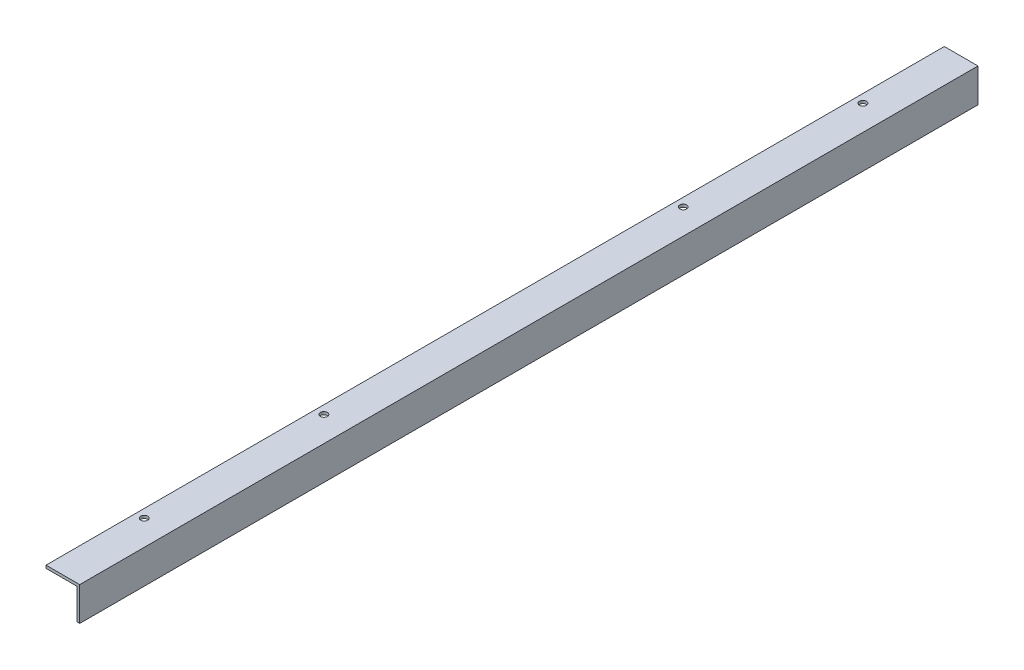
ISO-10303-21;
HEADER;
FILE_DESCRIPTION(('STEP AP214'),'2;1');
FILE_NAME('part.step','',(''),(''),'','','');
FILE_SCHEMA(('AUTOMOTIVE_DESIGN { 1 0 10303 214 1 1 1 1 }'));
ENDSEC;
DATA;
#1=APPLICATION_CONTEXT('core data for automotive mechanical design processes');
#2=APPLICATION_PROTOCOL_DEFINITION('international standard','automotive_design',2000,#1);
#3=PRODUCT_CONTEXT('',#1,'mechanical');
#4=PRODUCT('Part','Part','',(#3));
#5=PRODUCT_RELATED_PRODUCT_CATEGORY('part','',(#4));
#6=PRODUCT_DEFINITION_FORMATION('','',#4);
#7=PRODUCT_DEFINITION_CONTEXT('part definition',#1,'design');
#8=PRODUCT_DEFINITION('design','',#6,#7);
#9=PRODUCT_DEFINITION_SHAPE('','',#8);
#10=(LENGTH_UNIT() NAMED_UNIT(*) SI_UNIT(.MILLI.,.METRE.));
#11=(NAMED_UNIT(*) PLANE_ANGLE_UNIT() SI_UNIT($,.RADIAN.));
#12=(NAMED_UNIT(*) SI_UNIT($,.STERADIAN.) SOLID_ANGLE_UNIT());
#13=UNCERTAINTY_MEASURE_WITH_UNIT(LENGTH_MEASURE(1.E-05),#10,'distance_accuracy_value','');
#14=(GEOMETRIC_REPRESENTATION_CONTEXT(3) GLOBAL_UNCERTAINTY_ASSIGNED_CONTEXT((#13)) GLOBAL_UNIT_ASSIGNED_CONTEXT((#10,
#11,#12)) REPRESENTATION_CONTEXT('',''));
#15=CARTESIAN_POINT('',(0.,0.,0.));
#16=DIRECTION('',(0.,0.,1.));
#17=DIRECTION('',(1.,0.,0.));
#18=AXIS2_PLACEMENT_3D('',#15,#16,#17);
#19=CARTESIAN_POINT('',(-28.575,-41.275,914.4));
#20=DIRECTION('',(0.,1.,0.));
#21=DIRECTION('',(0.,0.,1.));
#22=AXIS2_PLACEMENT_3D('',#19,#20,#21);
#23=CYLINDRICAL_SURFACE('',#22,3.96874999999997);
#24=CARTESIAN_POINT('',(-28.575,-3.175,914.4));
#25=DIRECTION('',(0.,1.,0.));
#26=DIRECTION('',(0.,0.,1.));
#27=AXIS2_PLACEMENT_3D('',#24,#25,#26);
#28=CIRCLE('',#27,3.96874999999997);
#29=CARTESIAN_POINT('',(-28.575,-3.175,918.36875));
#30=VERTEX_POINT('',#29);
#31=EDGE_CURVE('E40',#30,#30,#28,.T.);
#32=ORIENTED_EDGE('',*,*,#31,.F.);
#33=EDGE_LOOP('',(#32));
#34=FACE_BOUND('',#33,.T.);
#35=CARTESIAN_POINT('',(-28.575,0.,914.4));
#36=DIRECTION('',(0.,-1.,0.));
#37=DIRECTION('',(1.,0.,0.));
#38=AXIS2_PLACEMENT_3D('',#35,#36,#37);
#39=CIRCLE('',#38,3.96874999999997);
#40=CARTESIAN_POINT('',(-24.60625,0.,914.4));
#41=VERTEX_POINT('',#40);
#42=EDGE_CURVE('E11',#41,#41,#39,.T.);
#43=ORIENTED_EDGE('',*,*,#42,.F.);
#44=EDGE_LOOP('',(#43));
#45=FACE_BOUND('',#44,.T.);
#46=ADVANCED_FACE('F32',(#34,#45),#23,.F.);
#47=CARTESIAN_POINT('',(-28.575,-41.275,711.2));
#48=DIRECTION('',(0.,1.,0.));
#49=DIRECTION('',(0.,0.,1.));
#50=AXIS2_PLACEMENT_3D('',#47,#48,#49);
#51=CYLINDRICAL_SURFACE('',#50,3.96874999999997);
#52=CARTESIAN_POINT('',(-28.575,-3.175,711.2));
#53=DIRECTION('',(0.,1.,0.));
#54=DIRECTION('',(0.,0.,1.));
#55=AXIS2_PLACEMENT_3D('',#52,#53,#54);
#56=CIRCLE('',#55,3.96874999999997);
#57=CARTESIAN_POINT('',(-28.575,-3.175,715.16875));
#58=VERTEX_POINT('',#57);
#59=EDGE_CURVE('E138',#58,#58,#56,.T.);
#60=ORIENTED_EDGE('',*,*,#59,.F.);
#61=EDGE_LOOP('',(#60));
#62=FACE_BOUND('',#61,.T.);
#63=CARTESIAN_POINT('',(-28.575,0.,711.2));
#64=DIRECTION('',(0.,-1.,0.));
#65=DIRECTION('',(1.,0.,0.));
#66=AXIS2_PLACEMENT_3D('',#63,#64,#65);
#67=CIRCLE('',#66,3.96874999999997);
#68=CARTESIAN_POINT('',(-24.60625,0.,711.2));
#69=VERTEX_POINT('',#68);
#70=EDGE_CURVE('E145',#69,#69,#67,.T.);
#71=ORIENTED_EDGE('',*,*,#70,.F.);
#72=EDGE_LOOP('',(#71));
#73=FACE_BOUND('',#72,.T.);
#74=ADVANCED_FACE('F153',(#62,#73),#51,.F.);
#75=CARTESIAN_POINT('',(0.,-38.1,1016.));
#76=DIRECTION('',(-1.,0.,0.));
#77=DIRECTION('',(0.,0.,1.));
#78=AXIS2_PLACEMENT_3D('',#75,#76,#77);
#79=PLANE('',#78);
#80=DIRECTION('',(0.,1.,0.));
#81=VECTOR('',#80,1.);
#82=CARTESIAN_POINT('',(0.,-38.1,0.));
#83=LINE('',#82,#81);
#84=CARTESIAN_POINT('',(0.,-38.1,0.));
#85=VERTEX_POINT('',#84);
#86=CARTESIAN_POINT('',(0.,0.,0.));
#87=VERTEX_POINT('',#86);
#88=EDGE_CURVE('E118',#85,#87,#83,.T.);
#89=ORIENTED_EDGE('',*,*,#88,.T.);
#90=DIRECTION('',(0.,0.,-1.));
#91=VECTOR('',#90,1.);
#92=CARTESIAN_POINT('',(0.,0.,1016.));
#93=LINE('',#92,#91);
#94=CARTESIAN_POINT('',(0.,0.,1016.));
#95=VERTEX_POINT('',#94);
#96=EDGE_CURVE('E136',#95,#87,#93,.T.);
#97=ORIENTED_EDGE('',*,*,#96,.F.);
#98=DIRECTION('',(0.,1.,0.));
#99=VECTOR('',#98,1.);
#100=CARTESIAN_POINT('',(0.,-38.1,1016.));
#101=LINE('',#100,#99);
#102=CARTESIAN_POINT('',(0.,-38.1,1016.));
#103=VERTEX_POINT('',#102);
#104=EDGE_CURVE('E129',#103,#95,#101,.T.);
#105=ORIENTED_EDGE('',*,*,#104,.F.);
#106=DIRECTION('',(0.,0.,-1.));
#107=VECTOR('',#106,1.);
#108=CARTESIAN_POINT('',(0.,-38.1,1016.));
#109=LINE('',#108,#107);
#110=EDGE_CURVE('E114',#103,#85,#109,.T.);
#111=ORIENTED_EDGE('',*,*,#110,.T.);
#112=EDGE_LOOP('',(#89,#97,#105,#111));
#113=FACE_BOUND('',#112,.T.);
#114=ADVANCED_FACE('F159',(#113),#79,.F.);
#115=CARTESIAN_POINT('',(0.,0.,1016.));
#116=DIRECTION('',(0.,-1.,0.));
#117=DIRECTION('',(1.,0.,0.));
#118=AXIS2_PLACEMENT_3D('',#115,#116,#117);
#119=PLANE('',#118);
#120=CARTESIAN_POINT('',(-28.575,0.,304.8));
#121=DIRECTION('',(0.,-1.,0.));
#122=DIRECTION('',(1.,0.,0.));
#123=AXIS2_PLACEMENT_3D('',#120,#121,#122);
#124=CIRCLE('',#123,3.96874999999997);
#125=CARTESIAN_POINT('',(-24.60625,0.,304.8));
#126=VERTEX_POINT('',#125);
#127=EDGE_CURVE('E142',#126,#126,#124,.T.);
#128=ORIENTED_EDGE('',*,*,#127,.T.);
#129=EDGE_LOOP('',(#128));
#130=FACE_BOUND('',#129,.T.);
#131=CARTESIAN_POINT('',(-28.575,0.,101.6));
#132=DIRECTION('',(0.,-1.,0.));
#133=DIRECTION('',(1.,0.,0.));
#134=AXIS2_PLACEMENT_3D('',#131,#132,#133);
#135=CIRCLE('',#134,3.96874999999997);
#136=CARTESIAN_POINT('',(-24.60625,0.,101.6));
#137=VERTEX_POINT('',#136);
#138=EDGE_CURVE('E122',#137,#137,#135,.T.);
#139=ORIENTED_EDGE('',*,*,#138,.T.);
#140=EDGE_LOOP('',(#139));
#141=FACE_BOUND('',#140,.T.);
#142=DIRECTION('',(-1.,0.,0.));
#143=VECTOR('',#142,1.);
#144=CARTESIAN_POINT('',(0.,0.,0.));
#145=LINE('',#144,#143);
#146=CARTESIAN_POINT('',(-38.1,0.,0.));
#147=VERTEX_POINT('',#146);
#148=EDGE_CURVE('E121',#87,#147,#145,.T.);
#149=ORIENTED_EDGE('',*,*,#148,.T.);
#150=DIRECTION('',(0.,0.,-1.));
#151=VECTOR('',#150,1.);
#152=CARTESIAN_POINT('',(-38.1,0.,1016.));
#153=LINE('',#152,#151);
#154=CARTESIAN_POINT('',(-38.1,0.,1016.));
#155=VERTEX_POINT('',#154);
#156=EDGE_CURVE('E133',#155,#147,#153,.T.);
#157=ORIENTED_EDGE('',*,*,#156,.F.);
#158=DIRECTION('',(-1.,0.,0.));
#159=VECTOR('',#158,1.);
#160=CARTESIAN_POINT('',(0.,0.,1016.));
#161=LINE('',#160,#159);
#162=EDGE_CURVE('E86',#95,#155,#161,.T.);
#163=ORIENTED_EDGE('',*,*,#162,.F.);
#164=ORIENTED_EDGE('',*,*,#96,.T.);
#165=EDGE_LOOP('',(#149,#157,#163,#164));
#166=FACE_BOUND('',#165,.T.);
#167=ORIENTED_EDGE('',*,*,#70,.T.);
#168=EDGE_LOOP('',(#167));
#169=FACE_BOUND('',#168,.T.);
#170=ORIENTED_EDGE('',*,*,#42,.T.);
#171=EDGE_LOOP('',(#170));
#172=FACE_BOUND('',#171,.T.);
#173=ADVANCED_FACE('F156',(#130,#141,#166,#169,#172),#119,.F.);
#174=CARTESIAN_POINT('',(-38.1,0.,1016.));
#175=DIRECTION('',(1.,0.,0.));
#176=DIRECTION('',(0.,0.,-1.));
#177=AXIS2_PLACEMENT_3D('',#174,#175,#176);
#178=PLANE('',#177);
#179=DIRECTION('',(0.,-1.,0.));
#180=VECTOR('',#179,1.);
#181=CARTESIAN_POINT('',(-38.1,0.,0.));
#182=LINE('',#181,#180);
#183=CARTESIAN_POINT('',(-38.1,-3.17500000000001,0.));
#184=VERTEX_POINT('',#183);
#185=EDGE_CURVE('E124',#147,#184,#182,.T.);
#186=ORIENTED_EDGE('',*,*,#185,.T.);
#187=DIRECTION('',(0.,0.,-1.));
#188=VECTOR('',#187,1.);
#189=CARTESIAN_POINT('',(-38.1,-3.17500000000001,1016.));
#190=LINE('',#189,#188);
#191=CARTESIAN_POINT('',(-38.1,-3.17500000000001,1016.));
#192=VERTEX_POINT('',#191);
#193=EDGE_CURVE('E109',#192,#184,#190,.T.);
#194=ORIENTED_EDGE('',*,*,#193,.F.);
#195=DIRECTION('',(0.,-1.,0.));
#196=VECTOR('',#195,1.);
#197=CARTESIAN_POINT('',(-38.1,0.,1016.));
#198=LINE('',#197,#196);
#199=EDGE_CURVE('E99',#155,#192,#198,.T.);
#200=ORIENTED_EDGE('',*,*,#199,.F.);
#201=ORIENTED_EDGE('',*,*,#156,.T.);
#202=EDGE_LOOP('',(#186,#194,#200,#201));
#203=FACE_BOUND('',#202,.T.);
#204=ADVANCED_FACE('F158',(#203),#178,.F.);
#205=CARTESIAN_POINT('',(-38.1,-3.17500000000001,1016.));
#206=DIRECTION('',(0.,1.,0.));
#207=DIRECTION('',(0.,0.,1.));
#208=AXIS2_PLACEMENT_3D('',#205,#206,#207);
#209=PLANE('',#208);
#210=CARTESIAN_POINT('',(-28.575,-3.175,304.8));
#211=DIRECTION('',(0.,1.,0.));
#212=DIRECTION('',(0.,0.,1.));
#213=AXIS2_PLACEMENT_3D('',#210,#211,#212);
#214=CIRCLE('',#213,3.96874999999997);
#215=CARTESIAN_POINT('',(-28.575,-3.175,308.76875));
#216=VERTEX_POINT('',#215);
#217=EDGE_CURVE('E210',#216,#216,#214,.T.);
#218=ORIENTED_EDGE('',*,*,#217,.T.);
#219=EDGE_LOOP('',(#218));
#220=FACE_BOUND('',#219,.T.);
#221=CARTESIAN_POINT('',(-28.575,-3.175,101.6));
#222=DIRECTION('',(0.,1.,0.));
#223=DIRECTION('',(0.,0.,1.));
#224=AXIS2_PLACEMENT_3D('',#221,#222,#223);
#225=CIRCLE('',#224,3.96874999999997);
#226=CARTESIAN_POINT('',(-28.575,-3.175,105.56875));
#227=VERTEX_POINT('',#226);
#228=EDGE_CURVE('E139',#227,#227,#225,.T.);
#229=ORIENTED_EDGE('',*,*,#228,.T.);
#230=EDGE_LOOP('',(#229));
#231=FACE_BOUND('',#230,.T.);
#232=DIRECTION('',(1.,0.,0.));
#233=VECTOR('',#232,1.);
#234=CARTESIAN_POINT('',(-38.1,-3.17500000000001,0.));
#235=LINE('',#234,#233);
#236=CARTESIAN_POINT('',(-3.17500000000001,-3.17500000000001,0.));
#237=VERTEX_POINT('',#236);
#238=EDGE_CURVE('E108',#184,#237,#235,.T.);
#239=ORIENTED_EDGE('',*,*,#238,.T.);
#240=DIRECTION('',(0.,0.,-1.));
#241=VECTOR('',#240,1.);
#242=CARTESIAN_POINT('',(-3.17500000000001,-3.17500000000001,1016.));
#243=LINE('',#242,#241);
#244=CARTESIAN_POINT('',(-3.17500000000001,-3.17500000000001,1016.));
#245=VERTEX_POINT('',#244);
#246=EDGE_CURVE('E104',#245,#237,#243,.T.);
#247=ORIENTED_EDGE('',*,*,#246,.F.);
#248=DIRECTION('',(1.,0.,0.));
#249=VECTOR('',#248,1.);
#250=CARTESIAN_POINT('',(-38.1,-3.17500000000001,1016.));
#251=LINE('',#250,#249);
#252=EDGE_CURVE('E93',#192,#245,#251,.T.);
#253=ORIENTED_EDGE('',*,*,#252,.F.);
#254=ORIENTED_EDGE('',*,*,#193,.T.);
#255=EDGE_LOOP('',(#239,#247,#253,#254));
#256=FACE_BOUND('',#255,.T.);
#257=ORIENTED_EDGE('',*,*,#59,.T.);
#258=EDGE_LOOP('',(#257));
#259=FACE_BOUND('',#258,.T.);
#260=ORIENTED_EDGE('',*,*,#31,.T.);
#261=EDGE_LOOP('',(#260));
#262=FACE_BOUND('',#261,.T.);
#263=ADVANCED_FACE('F105',(#220,#231,#256,#259,#262),#209,.F.);
#264=CARTESIAN_POINT('',(-3.17500000000001,-3.17500000000001,1016.));
#265=DIRECTION('',(1.,0.,0.));
#266=DIRECTION('',(0.,1.,0.));
#267=AXIS2_PLACEMENT_3D('',#264,#265,#266);
#268=PLANE('',#267);
#269=DIRECTION('',(0.,-1.,0.));
#270=VECTOR('',#269,1.);
#271=CARTESIAN_POINT('',(-3.17500000000001,-3.17500000000001,0.));
#272=LINE('',#271,#270);
#273=CARTESIAN_POINT('',(-3.175,-38.1,0.));
#274=VERTEX_POINT('',#273);
#275=EDGE_CURVE('E71',#237,#274,#272,.T.);
#276=ORIENTED_EDGE('',*,*,#275,.T.);
#277=DIRECTION('',(0.,0.,-1.));
#278=VECTOR('',#277,1.);
#279=CARTESIAN_POINT('',(-3.175,-38.1,1016.));
#280=LINE('',#279,#278);
#281=CARTESIAN_POINT('',(-3.175,-38.1,1016.));
#282=VERTEX_POINT('',#281);
#283=EDGE_CURVE('E110',#282,#274,#280,.T.);
#284=ORIENTED_EDGE('',*,*,#283,.F.);
#285=DIRECTION('',(0.,-1.,0.));
#286=VECTOR('',#285,1.);
#287=CARTESIAN_POINT('',(-3.17500000000001,-3.17500000000001,1016.));
#288=LINE('',#287,#286);
#289=EDGE_CURVE('E97',#245,#282,#288,.T.);
#290=ORIENTED_EDGE('',*,*,#289,.F.);
#291=ORIENTED_EDGE('',*,*,#246,.T.);
#292=EDGE_LOOP('',(#276,#284,#290,#291));
#293=FACE_BOUND('',#292,.T.);
#294=ADVANCED_FACE('F112',(#293),#268,.F.);
#295=CARTESIAN_POINT('',(-3.175,-38.1,1016.));
#296=DIRECTION('',(0.,1.,0.));
#297=DIRECTION('',(0.,0.,1.));
#298=AXIS2_PLACEMENT_3D('',#295,#296,#297);
#299=PLANE('',#298);
#300=DIRECTION('',(1.,0.,0.));
#301=VECTOR('',#300,1.);
#302=CARTESIAN_POINT('',(-3.175,-38.1,0.));
#303=LINE('',#302,#301);
#304=EDGE_CURVE('E77',#274,#85,#303,.T.);
#305=ORIENTED_EDGE('',*,*,#304,.T.);
#306=ORIENTED_EDGE('',*,*,#110,.F.);
#307=DIRECTION('',(1.,0.,0.));
#308=VECTOR('',#307,1.);
#309=CARTESIAN_POINT('',(-3.175,-38.1,1016.));
#310=LINE('',#309,#308);
#311=EDGE_CURVE('E48',#282,#103,#310,.T.);
#312=ORIENTED_EDGE('',*,*,#311,.F.);
#313=ORIENTED_EDGE('',*,*,#283,.T.);
#314=EDGE_LOOP('',(#305,#306,#312,#313));
#315=FACE_BOUND('',#314,.T.);
#316=ADVANCED_FACE('F186',(#315),#299,.F.);
#317=CARTESIAN_POINT('',(0.,0.,1016.));
#318=DIRECTION('',(0.,0.,1.));
#319=DIRECTION('',(1.,0.,0.));
#320=AXIS2_PLACEMENT_3D('',#317,#318,#319);
#321=PLANE('',#320);
#322=ORIENTED_EDGE('',*,*,#104,.T.);
#323=ORIENTED_EDGE('',*,*,#162,.T.);
#324=ORIENTED_EDGE('',*,*,#199,.T.);
#325=ORIENTED_EDGE('',*,*,#252,.T.);
#326=ORIENTED_EDGE('',*,*,#289,.T.);
#327=ORIENTED_EDGE('',*,*,#311,.T.);
#328=EDGE_LOOP('',(#322,#323,#324,#325,#326,#327));
#329=FACE_BOUND('',#328,.T.);
#330=ADVANCED_FACE('F95',(#329),#321,.T.);
#331=CARTESIAN_POINT('',(0.,0.,0.));
#332=DIRECTION('',(0.,0.,1.));
#333=DIRECTION('',(1.,0.,0.));
#334=AXIS2_PLACEMENT_3D('',#331,#332,#333);
#335=PLANE('',#334);
#336=ORIENTED_EDGE('',*,*,#88,.F.);
#337=ORIENTED_EDGE('',*,*,#304,.F.);
#338=ORIENTED_EDGE('',*,*,#275,.F.);
#339=ORIENTED_EDGE('',*,*,#238,.F.);
#340=ORIENTED_EDGE('',*,*,#185,.F.);
#341=ORIENTED_EDGE('',*,*,#148,.F.);
#342=EDGE_LOOP('',(#336,#337,#338,#339,#340,#341));
#343=FACE_BOUND('',#342,.T.);
#344=ADVANCED_FACE('F193',(#343),#335,.F.);
#345=CARTESIAN_POINT('',(-28.575,-41.275,101.6));
#346=DIRECTION('',(0.,1.,0.));
#347=DIRECTION('',(0.,0.,1.));
#348=AXIS2_PLACEMENT_3D('',#345,#346,#347);
#349=CYLINDRICAL_SURFACE('',#348,3.96874999999997);
#350=ORIENTED_EDGE('',*,*,#228,.F.);
#351=EDGE_LOOP('',(#350));
#352=FACE_BOUND('',#351,.T.);
#353=ORIENTED_EDGE('',*,*,#138,.F.);
#354=EDGE_LOOP('',(#353));
#355=FACE_BOUND('',#354,.T.);
#356=ADVANCED_FACE('F196',(#352,#355),#349,.F.);
#357=CARTESIAN_POINT('',(-28.575,-41.275,304.8));
#358=DIRECTION('',(0.,1.,0.));
#359=DIRECTION('',(0.,0.,1.));
#360=AXIS2_PLACEMENT_3D('',#357,#358,#359);
#361=CYLINDRICAL_SURFACE('',#360,3.96874999999997);
#362=ORIENTED_EDGE('',*,*,#217,.F.);
#363=EDGE_LOOP('',(#362));
#364=FACE_BOUND('',#363,.T.);
#365=ORIENTED_EDGE('',*,*,#127,.F.);
#366=EDGE_LOOP('',(#365));
#367=FACE_BOUND('',#366,.T.);
#368=ADVANCED_FACE('F202',(#364,#367),#361,.F.);
#369=CLOSED_SHELL('',(#46,#74,#114,#173,#204,#263,#294,#316,#330,#344,#356,#368));
#370=MANIFOLD_SOLID_BREP('B2',#369);
#371=ADVANCED_BREP_SHAPE_REPRESENTATION('',(#18,#370),#14);
#372=SHAPE_DEFINITION_REPRESENTATION(#9,#371);
ENDSEC;
END-ISO-10303-21;
